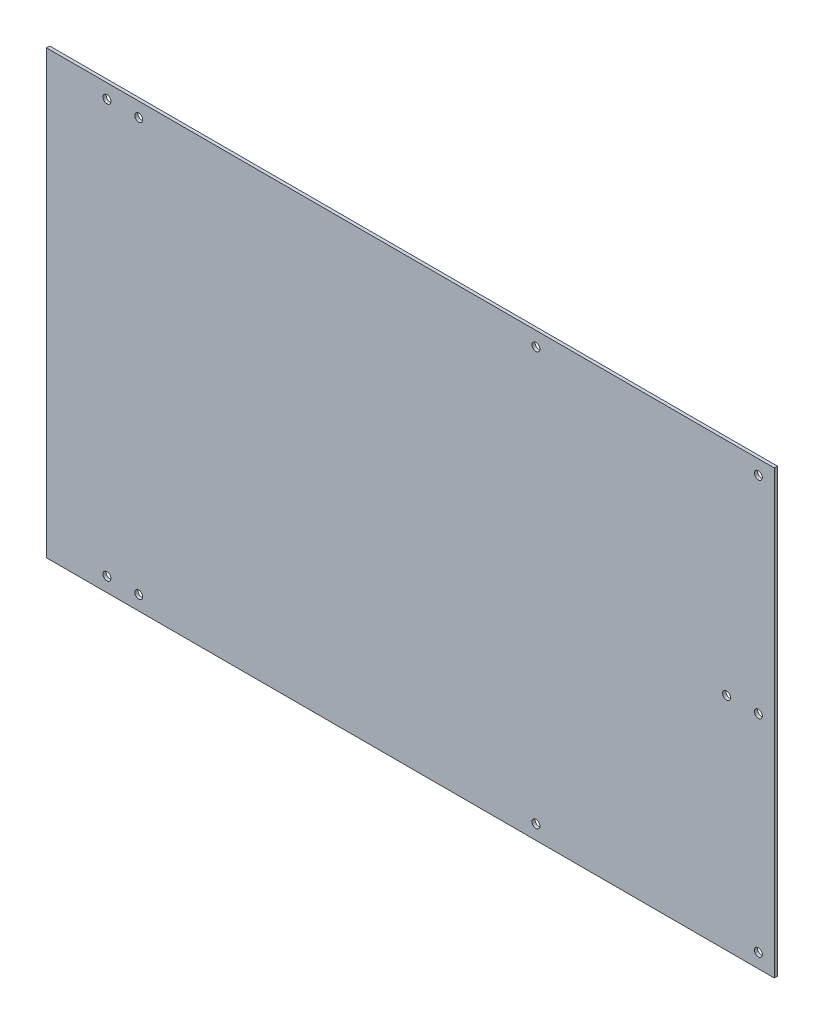
ISO-10303-21;
HEADER;
FILE_DESCRIPTION(('STEP AP214'),'2;1');
FILE_NAME('part.step','',(''),(''),'','','');
FILE_SCHEMA(('AUTOMOTIVE_DESIGN { 1 0 10303 214 1 1 1 1 }'));
ENDSEC;
DATA;
#1=APPLICATION_CONTEXT('core data for automotive mechanical design processes');
#2=APPLICATION_PROTOCOL_DEFINITION('international standard','automotive_design',2000,#1);
#3=PRODUCT_CONTEXT('',#1,'mechanical');
#4=PRODUCT('Part','Part','',(#3));
#5=PRODUCT_RELATED_PRODUCT_CATEGORY('part','',(#4));
#6=PRODUCT_DEFINITION_FORMATION('','',#4);
#7=PRODUCT_DEFINITION_CONTEXT('part definition',#1,'design');
#8=PRODUCT_DEFINITION('design','',#6,#7);
#9=PRODUCT_DEFINITION_SHAPE('','',#8);
#10=(LENGTH_UNIT() NAMED_UNIT(*) SI_UNIT(.MILLI.,.METRE.));
#11=(NAMED_UNIT(*) PLANE_ANGLE_UNIT() SI_UNIT($,.RADIAN.));
#12=(NAMED_UNIT(*) SI_UNIT($,.STERADIAN.) SOLID_ANGLE_UNIT());
#13=UNCERTAINTY_MEASURE_WITH_UNIT(LENGTH_MEASURE(1.E-05),#10,'distance_accuracy_value','');
#14=(GEOMETRIC_REPRESENTATION_CONTEXT(3) GLOBAL_UNCERTAINTY_ASSIGNED_CONTEXT((#13)) GLOBAL_UNIT_ASSIGNED_CONTEXT((#10,
#11,#12)) REPRESENTATION_CONTEXT('',''));
#15=CARTESIAN_POINT('',(0.,0.,0.));
#16=DIRECTION('',(0.,0.,1.));
#17=DIRECTION('',(1.,0.,0.));
#18=AXIS2_PLACEMENT_3D('',#15,#16,#17);
#19=CARTESIAN_POINT('',(0.,0.,2.));
#20=DIRECTION('',(0.,0.,-1.));
#21=DIRECTION('',(-1.,0.,0.));
#22=AXIS2_PLACEMENT_3D('',#19,#20,#21);
#23=PLANE('',#22);
#24=DIRECTION('',(0.,-1.,0.));
#25=VECTOR('',#24,1.);
#26=CARTESIAN_POINT('',(-113.50919013501,-235.636228994094,2.));
#27=LINE('',#26,#25);
#28=CARTESIAN_POINT('',(-113.50919013501,42.3637710059059,2.));
#29=VERTEX_POINT('',#28);
#30=CARTESIAN_POINT('',(-113.50919013501,-235.636228994094,2.));
#31=VERTEX_POINT('',#30);
#32=EDGE_CURVE('E87',#29,#31,#27,.T.);
#33=ORIENTED_EDGE('',*,*,#32,.T.);
#34=DIRECTION('',(1.,0.,0.));
#35=VECTOR('',#34,1.);
#36=CARTESIAN_POINT('',(344.49080986499,-235.636228994094,2.));
#37=LINE('',#36,#35);
#38=CARTESIAN_POINT('',(344.49080986499,-235.636228994094,2.));
#39=VERTEX_POINT('',#38);
#40=EDGE_CURVE('E82',#31,#39,#37,.T.);
#41=ORIENTED_EDGE('',*,*,#40,.T.);
#42=DIRECTION('',(0.,1.,0.));
#43=VECTOR('',#42,1.);
#44=CARTESIAN_POINT('',(344.49080986499,42.3637710059059,2.));
#45=LINE('',#44,#43);
#46=CARTESIAN_POINT('',(344.49080986499,42.3637710059059,2.));
#47=VERTEX_POINT('',#46);
#48=EDGE_CURVE('E85',#39,#47,#45,.T.);
#49=ORIENTED_EDGE('',*,*,#48,.T.);
#50=DIRECTION('',(-1.,0.,0.));
#51=VECTOR('',#50,1.);
#52=CARTESIAN_POINT('',(-113.50919013501,42.3637710059059,2.));
#53=LINE('',#52,#51);
#54=EDGE_CURVE('E52',#47,#29,#53,.T.);
#55=ORIENTED_EDGE('',*,*,#54,.T.);
#56=EDGE_LOOP('',(#33,#41,#49,#55));
#57=FACE_BOUND('',#56,.T.);
#58=CARTESIAN_POINT('',(334.49080986499,-226.636228994094,2.));
#59=DIRECTION('',(0.,0.,1.));
#60=DIRECTION('',(1.,0.,0.));
#61=AXIS2_PLACEMENT_3D('',#58,#59,#60);
#62=CIRCLE('',#61,2.49999999999997);
#63=CARTESIAN_POINT('',(336.99080986499,-226.636228994094,2.));
#64=VERTEX_POINT('',#63);
#65=EDGE_CURVE('E102',#64,#64,#62,.T.);
#66=ORIENTED_EDGE('',*,*,#65,.F.);
#67=EDGE_LOOP('',(#66));
#68=FACE_BOUND('',#67,.T.);
#69=CARTESIAN_POINT('',(194.49080986499,-226.636228994094,2.));
#70=DIRECTION('',(0.,0.,1.));
#71=DIRECTION('',(1.,0.,0.));
#72=AXIS2_PLACEMENT_3D('',#69,#70,#71);
#73=CIRCLE('',#72,2.5);
#74=CARTESIAN_POINT('',(196.99080986499,-226.636228994094,2.));
#75=VERTEX_POINT('',#74);
#76=EDGE_CURVE('E117',#75,#75,#73,.T.);
#77=ORIENTED_EDGE('',*,*,#76,.F.);
#78=EDGE_LOOP('',(#77));
#79=FACE_BOUND('',#78,.T.);
#80=CARTESIAN_POINT('',(194.49080986499,33.3637710059059,2.));
#81=DIRECTION('',(0.,0.,1.));
#82=DIRECTION('',(-1.,0.,0.));
#83=AXIS2_PLACEMENT_3D('',#80,#81,#82);
#84=CIRCLE('',#83,2.5);
#85=CARTESIAN_POINT('',(191.99080986499,33.3637710059059,2.));
#86=VERTEX_POINT('',#85);
#87=EDGE_CURVE('E123',#86,#86,#84,.T.);
#88=ORIENTED_EDGE('',*,*,#87,.F.);
#89=EDGE_LOOP('',(#88));
#90=FACE_BOUND('',#89,.T.);
#91=CARTESIAN_POINT('',(334.49080986499,33.3637710059059,2.));
#92=DIRECTION('',(0.,0.,1.));
#93=DIRECTION('',(-1.,0.,0.));
#94=AXIS2_PLACEMENT_3D('',#91,#92,#93);
#95=CIRCLE('',#94,2.49999999999997);
#96=CARTESIAN_POINT('',(331.99080986499,33.3637710059059,2.));
#97=VERTEX_POINT('',#96);
#98=EDGE_CURVE('E129',#97,#97,#95,.T.);
#99=ORIENTED_EDGE('',*,*,#98,.F.);
#100=EDGE_LOOP('',(#99));
#101=FACE_BOUND('',#100,.T.);
#102=CARTESIAN_POINT('',(-55.5091901350102,33.3637710059059,2.));
#103=DIRECTION('',(0.,0.,1.));
#104=DIRECTION('',(1.,0.,0.));
#105=AXIS2_PLACEMENT_3D('',#102,#103,#104);
#106=CIRCLE('',#105,2.5);
#107=CARTESIAN_POINT('',(-53.0091901350102,33.3637710059059,2.));
#108=VERTEX_POINT('',#107);
#109=EDGE_CURVE('E135',#108,#108,#106,.T.);
#110=ORIENTED_EDGE('',*,*,#109,.F.);
#111=EDGE_LOOP('',(#110));
#112=FACE_BOUND('',#111,.T.);
#113=CARTESIAN_POINT('',(-75.5091901350102,33.3637710059059,2.));
#114=DIRECTION('',(0.,0.,1.));
#115=DIRECTION('',(1.,0.,0.));
#116=AXIS2_PLACEMENT_3D('',#113,#114,#115);
#117=CIRCLE('',#116,2.5);
#118=CARTESIAN_POINT('',(-73.0091901350102,33.3637710059059,2.));
#119=VERTEX_POINT('',#118);
#120=EDGE_CURVE('E141',#119,#119,#117,.T.);
#121=ORIENTED_EDGE('',*,*,#120,.F.);
#122=EDGE_LOOP('',(#121));
#123=FACE_BOUND('',#122,.T.);
#124=CARTESIAN_POINT('',(-75.50919013501,-226.636228994094,2.));
#125=DIRECTION('',(0.,0.,1.));
#126=DIRECTION('',(-1.,0.,0.));
#127=AXIS2_PLACEMENT_3D('',#124,#125,#126);
#128=CIRCLE('',#127,2.5);
#129=CARTESIAN_POINT('',(-78.00919013501,-226.636228994094,2.));
#130=VERTEX_POINT('',#129);
#131=EDGE_CURVE('E147',#130,#130,#128,.T.);
#132=ORIENTED_EDGE('',*,*,#131,.F.);
#133=EDGE_LOOP('',(#132));
#134=FACE_BOUND('',#133,.T.);
#135=CARTESIAN_POINT('',(-55.50919013501,-226.636228994094,2.));
#136=DIRECTION('',(0.,0.,1.));
#137=DIRECTION('',(-1.,0.,0.));
#138=AXIS2_PLACEMENT_3D('',#135,#136,#137);
#139=CIRCLE('',#138,2.5);
#140=CARTESIAN_POINT('',(-58.00919013501,-226.636228994094,2.));
#141=VERTEX_POINT('',#140);
#142=EDGE_CURVE('E153',#141,#141,#139,.T.);
#143=ORIENTED_EDGE('',*,*,#142,.F.);
#144=EDGE_LOOP('',(#143));
#145=FACE_BOUND('',#144,.T.);
#146=CARTESIAN_POINT('',(334.49080986499,-96.6362289940941,2.));
#147=DIRECTION('',(0.,0.,1.));
#148=DIRECTION('',(1.,0.,0.));
#149=AXIS2_PLACEMENT_3D('',#146,#147,#148);
#150=CIRCLE('',#149,2.50000000000002);
#151=CARTESIAN_POINT('',(336.99080986499,-96.6362289940941,2.));
#152=VERTEX_POINT('',#151);
#153=EDGE_CURVE('E159',#152,#152,#150,.T.);
#154=ORIENTED_EDGE('',*,*,#153,.F.);
#155=EDGE_LOOP('',(#154));
#156=FACE_BOUND('',#155,.T.);
#157=CARTESIAN_POINT('',(314.49080986499,-96.6362289940941,2.));
#158=DIRECTION('',(0.,0.,1.));
#159=DIRECTION('',(1.,0.,0.));
#160=AXIS2_PLACEMENT_3D('',#157,#158,#159);
#161=CIRCLE('',#160,2.49999999999997);
#162=CARTESIAN_POINT('',(316.99080986499,-96.6362289940941,2.));
#163=VERTEX_POINT('',#162);
#164=EDGE_CURVE('E165',#163,#163,#161,.T.);
#165=ORIENTED_EDGE('',*,*,#164,.F.);
#166=EDGE_LOOP('',(#165));
#167=FACE_BOUND('',#166,.T.);
#168=ADVANCED_FACE('F35',(#57,#68,#79,#90,#101,#112,#123,#134,#145,#156,#167),#23,.F.);
#169=CARTESIAN_POINT('',(0.,0.,0.));
#170=DIRECTION('',(0.,0.,-1.));
#171=DIRECTION('',(-1.,0.,0.));
#172=AXIS2_PLACEMENT_3D('',#169,#170,#171);
#173=PLANE('',#172);
#174=CARTESIAN_POINT('',(334.49080986499,-96.6362289940941,0.));
#175=DIRECTION('',(0.,0.,1.));
#176=DIRECTION('',(1.,0.,0.));
#177=AXIS2_PLACEMENT_3D('',#174,#175,#176);
#178=CIRCLE('',#177,2.50000000000002);
#179=CARTESIAN_POINT('',(336.99080986499,-96.6362289940941,0.));
#180=VERTEX_POINT('',#179);
#181=EDGE_CURVE('E162',#180,#180,#178,.T.);
#182=ORIENTED_EDGE('',*,*,#181,.T.);
#183=EDGE_LOOP('',(#182));
#184=FACE_BOUND('',#183,.T.);
#185=CARTESIAN_POINT('',(-75.50919013501,-226.636228994094,0.));
#186=DIRECTION('',(0.,0.,1.));
#187=DIRECTION('',(-1.,0.,0.));
#188=AXIS2_PLACEMENT_3D('',#185,#186,#187);
#189=CIRCLE('',#188,2.5);
#190=CARTESIAN_POINT('',(-78.00919013501,-226.636228994094,0.));
#191=VERTEX_POINT('',#190);
#192=EDGE_CURVE('E150',#191,#191,#189,.T.);
#193=ORIENTED_EDGE('',*,*,#192,.T.);
#194=EDGE_LOOP('',(#193));
#195=FACE_BOUND('',#194,.T.);
#196=CARTESIAN_POINT('',(-55.5091901350102,33.3637710059059,0.));
#197=DIRECTION('',(0.,0.,1.));
#198=DIRECTION('',(1.,0.,0.));
#199=AXIS2_PLACEMENT_3D('',#196,#197,#198);
#200=CIRCLE('',#199,2.5);
#201=CARTESIAN_POINT('',(-53.0091901350102,33.3637710059059,0.));
#202=VERTEX_POINT('',#201);
#203=EDGE_CURVE('E138',#202,#202,#200,.T.);
#204=ORIENTED_EDGE('',*,*,#203,.T.);
#205=EDGE_LOOP('',(#204));
#206=FACE_BOUND('',#205,.T.);
#207=CARTESIAN_POINT('',(194.49080986499,33.3637710059059,0.));
#208=DIRECTION('',(0.,0.,1.));
#209=DIRECTION('',(-1.,0.,0.));
#210=AXIS2_PLACEMENT_3D('',#207,#208,#209);
#211=CIRCLE('',#210,2.5);
#212=CARTESIAN_POINT('',(191.99080986499,33.3637710059059,0.));
#213=VERTEX_POINT('',#212);
#214=EDGE_CURVE('E126',#213,#213,#211,.T.);
#215=ORIENTED_EDGE('',*,*,#214,.T.);
#216=EDGE_LOOP('',(#215));
#217=FACE_BOUND('',#216,.T.);
#218=CARTESIAN_POINT('',(334.49080986499,-226.636228994094,0.));
#219=DIRECTION('',(0.,0.,1.));
#220=DIRECTION('',(1.,0.,0.));
#221=AXIS2_PLACEMENT_3D('',#218,#219,#220);
#222=CIRCLE('',#221,2.49999999999997);
#223=CARTESIAN_POINT('',(336.99080986499,-226.636228994094,0.));
#224=VERTEX_POINT('',#223);
#225=EDGE_CURVE('E114',#224,#224,#222,.T.);
#226=ORIENTED_EDGE('',*,*,#225,.T.);
#227=EDGE_LOOP('',(#226));
#228=FACE_BOUND('',#227,.T.);
#229=DIRECTION('',(0.,-1.,0.));
#230=VECTOR('',#229,1.);
#231=CARTESIAN_POINT('',(-113.50919013501,-235.636228994094,0.));
#232=LINE('',#231,#230);
#233=CARTESIAN_POINT('',(-113.50919013501,42.3637710059059,0.));
#234=VERTEX_POINT('',#233);
#235=CARTESIAN_POINT('',(-113.50919013501,-235.636228994094,0.));
#236=VERTEX_POINT('',#235);
#237=EDGE_CURVE('E99',#234,#236,#232,.T.);
#238=ORIENTED_EDGE('',*,*,#237,.F.);
#239=DIRECTION('',(-1.,0.,0.));
#240=VECTOR('',#239,1.);
#241=CARTESIAN_POINT('',(-113.50919013501,42.3637710059059,0.));
#242=LINE('',#241,#240);
#243=CARTESIAN_POINT('',(344.49080986499,42.3637710059059,0.));
#244=VERTEX_POINT('',#243);
#245=EDGE_CURVE('E75',#244,#234,#242,.T.);
#246=ORIENTED_EDGE('',*,*,#245,.F.);
#247=DIRECTION('',(0.,1.,0.));
#248=VECTOR('',#247,1.);
#249=CARTESIAN_POINT('',(344.49080986499,42.3637710059059,0.));
#250=LINE('',#249,#248);
#251=CARTESIAN_POINT('',(344.49080986499,-235.636228994094,0.));
#252=VERTEX_POINT('',#251);
#253=EDGE_CURVE('E69',#252,#244,#250,.T.);
#254=ORIENTED_EDGE('',*,*,#253,.F.);
#255=DIRECTION('',(1.,0.,0.));
#256=VECTOR('',#255,1.);
#257=CARTESIAN_POINT('',(344.49080986499,-235.636228994094,0.));
#258=LINE('',#257,#256);
#259=EDGE_CURVE('E91',#236,#252,#258,.T.);
#260=ORIENTED_EDGE('',*,*,#259,.F.);
#261=EDGE_LOOP('',(#238,#246,#254,#260));
#262=FACE_BOUND('',#261,.T.);
#263=CARTESIAN_POINT('',(194.49080986499,-226.636228994094,0.));
#264=DIRECTION('',(0.,0.,1.));
#265=DIRECTION('',(1.,0.,0.));
#266=AXIS2_PLACEMENT_3D('',#263,#264,#265);
#267=CIRCLE('',#266,2.5);
#268=CARTESIAN_POINT('',(196.99080986499,-226.636228994094,0.));
#269=VERTEX_POINT('',#268);
#270=EDGE_CURVE('E120',#269,#269,#267,.T.);
#271=ORIENTED_EDGE('',*,*,#270,.T.);
#272=EDGE_LOOP('',(#271));
#273=FACE_BOUND('',#272,.T.);
#274=CARTESIAN_POINT('',(334.49080986499,33.3637710059059,0.));
#275=DIRECTION('',(0.,0.,1.));
#276=DIRECTION('',(-1.,0.,0.));
#277=AXIS2_PLACEMENT_3D('',#274,#275,#276);
#278=CIRCLE('',#277,2.49999999999997);
#279=CARTESIAN_POINT('',(331.99080986499,33.3637710059059,0.));
#280=VERTEX_POINT('',#279);
#281=EDGE_CURVE('E132',#280,#280,#278,.T.);
#282=ORIENTED_EDGE('',*,*,#281,.T.);
#283=EDGE_LOOP('',(#282));
#284=FACE_BOUND('',#283,.T.);
#285=CARTESIAN_POINT('',(-75.5091901350102,33.3637710059059,0.));
#286=DIRECTION('',(0.,0.,1.));
#287=DIRECTION('',(1.,0.,0.));
#288=AXIS2_PLACEMENT_3D('',#285,#286,#287);
#289=CIRCLE('',#288,2.5);
#290=CARTESIAN_POINT('',(-73.0091901350102,33.3637710059059,0.));
#291=VERTEX_POINT('',#290);
#292=EDGE_CURVE('E144',#291,#291,#289,.T.);
#293=ORIENTED_EDGE('',*,*,#292,.T.);
#294=EDGE_LOOP('',(#293));
#295=FACE_BOUND('',#294,.T.);
#296=CARTESIAN_POINT('',(-55.50919013501,-226.636228994094,0.));
#297=DIRECTION('',(0.,0.,1.));
#298=DIRECTION('',(-1.,0.,0.));
#299=AXIS2_PLACEMENT_3D('',#296,#297,#298);
#300=CIRCLE('',#299,2.5);
#301=CARTESIAN_POINT('',(-58.00919013501,-226.636228994094,0.));
#302=VERTEX_POINT('',#301);
#303=EDGE_CURVE('E156',#302,#302,#300,.T.);
#304=ORIENTED_EDGE('',*,*,#303,.T.);
#305=EDGE_LOOP('',(#304));
#306=FACE_BOUND('',#305,.T.);
#307=CARTESIAN_POINT('',(314.49080986499,-96.6362289940941,0.));
#308=DIRECTION('',(0.,0.,1.));
#309=DIRECTION('',(1.,0.,0.));
#310=AXIS2_PLACEMENT_3D('',#307,#308,#309);
#311=CIRCLE('',#310,2.49999999999997);
#312=CARTESIAN_POINT('',(316.99080986499,-96.6362289940941,0.));
#313=VERTEX_POINT('',#312);
#314=EDGE_CURVE('E168',#313,#313,#311,.T.);
#315=ORIENTED_EDGE('',*,*,#314,.T.);
#316=EDGE_LOOP('',(#315));
#317=FACE_BOUND('',#316,.T.);
#318=ADVANCED_FACE('F110',(#184,#195,#206,#217,#228,#262,#273,#284,#295,#306,#317),#173,.T.);
#319=CARTESIAN_POINT('',(-113.50919013501,-235.636228994094,2.));
#320=DIRECTION('',(1.,0.,0.));
#321=DIRECTION('',(0.,0.,-1.));
#322=AXIS2_PLACEMENT_3D('',#319,#320,#321);
#323=PLANE('',#322);
#324=ORIENTED_EDGE('',*,*,#237,.T.);
#325=DIRECTION('',(0.,0.,-1.));
#326=VECTOR('',#325,1.);
#327=CARTESIAN_POINT('',(-113.50919013501,-235.636228994094,2.));
#328=LINE('',#327,#326);
#329=EDGE_CURVE('E11',#31,#236,#328,.T.);
#330=ORIENTED_EDGE('',*,*,#329,.F.);
#331=ORIENTED_EDGE('',*,*,#32,.F.);
#332=DIRECTION('',(0.,0.,-1.));
#333=VECTOR('',#332,1.);
#334=CARTESIAN_POINT('',(-113.50919013501,42.3637710059059,2.));
#335=LINE('',#334,#333);
#336=EDGE_CURVE('E95',#29,#234,#335,.T.);
#337=ORIENTED_EDGE('',*,*,#336,.T.);
#338=EDGE_LOOP('',(#324,#330,#331,#337));
#339=FACE_BOUND('',#338,.T.);
#340=ADVANCED_FACE('F37',(#339),#323,.F.);
#341=CARTESIAN_POINT('',(344.49080986499,-235.636228994094,2.));
#342=DIRECTION('',(0.,1.,0.));
#343=DIRECTION('',(-1.,0.,0.));
#344=AXIS2_PLACEMENT_3D('',#341,#342,#343);
#345=PLANE('',#344);
#346=ORIENTED_EDGE('',*,*,#259,.T.);
#347=DIRECTION('',(0.,0.,-1.));
#348=VECTOR('',#347,1.);
#349=CARTESIAN_POINT('',(344.49080986499,-235.636228994094,2.));
#350=LINE('',#349,#348);
#351=EDGE_CURVE('E44',#39,#252,#350,.T.);
#352=ORIENTED_EDGE('',*,*,#351,.F.);
#353=ORIENTED_EDGE('',*,*,#40,.F.);
#354=ORIENTED_EDGE('',*,*,#329,.T.);
#355=EDGE_LOOP('',(#346,#352,#353,#354));
#356=FACE_BOUND('',#355,.T.);
#357=ADVANCED_FACE('F90',(#356),#345,.F.);
#358=CARTESIAN_POINT('',(344.49080986499,42.3637710059059,2.));
#359=DIRECTION('',(-1.,0.,0.));
#360=DIRECTION('',(0.,0.,1.));
#361=AXIS2_PLACEMENT_3D('',#358,#359,#360);
#362=PLANE('',#361);
#363=ORIENTED_EDGE('',*,*,#253,.T.);
#364=DIRECTION('',(0.,0.,-1.));
#365=VECTOR('',#364,1.);
#366=CARTESIAN_POINT('',(344.49080986499,42.3637710059059,2.));
#367=LINE('',#366,#365);
#368=EDGE_CURVE('E92',#47,#244,#367,.T.);
#369=ORIENTED_EDGE('',*,*,#368,.F.);
#370=ORIENTED_EDGE('',*,*,#48,.F.);
#371=ORIENTED_EDGE('',*,*,#351,.T.);
#372=EDGE_LOOP('',(#363,#369,#370,#371));
#373=FACE_BOUND('',#372,.T.);
#374=ADVANCED_FACE('F93',(#373),#362,.F.);
#375=CARTESIAN_POINT('',(-113.50919013501,42.3637710059059,2.));
#376=DIRECTION('',(0.,-1.,0.));
#377=DIRECTION('',(0.,0.,-1.));
#378=AXIS2_PLACEMENT_3D('',#375,#376,#377);
#379=PLANE('',#378);
#380=ORIENTED_EDGE('',*,*,#245,.T.);
#381=ORIENTED_EDGE('',*,*,#336,.F.);
#382=ORIENTED_EDGE('',*,*,#54,.F.);
#383=ORIENTED_EDGE('',*,*,#368,.T.);
#384=EDGE_LOOP('',(#380,#381,#382,#383));
#385=FACE_BOUND('',#384,.T.);
#386=ADVANCED_FACE('F107',(#385),#379,.F.);
#387=CARTESIAN_POINT('',(334.49080986499,-226.636228994094,2.));
#388=DIRECTION('',(0.,0.,-1.));
#389=DIRECTION('',(-1.,0.,0.));
#390=AXIS2_PLACEMENT_3D('',#387,#388,#389);
#391=CYLINDRICAL_SURFACE('',#390,2.49999999999997);
#392=ORIENTED_EDGE('',*,*,#65,.T.);
#393=EDGE_LOOP('',(#392));
#394=FACE_BOUND('',#393,.T.);
#395=ORIENTED_EDGE('',*,*,#225,.F.);
#396=EDGE_LOOP('',(#395));
#397=FACE_BOUND('',#396,.T.);
#398=ADVANCED_FACE('F185',(#394,#397),#391,.F.);
#399=CARTESIAN_POINT('',(194.49080986499,-226.636228994094,2.));
#400=DIRECTION('',(0.,0.,-1.));
#401=DIRECTION('',(-1.,0.,0.));
#402=AXIS2_PLACEMENT_3D('',#399,#400,#401);
#403=CYLINDRICAL_SURFACE('',#402,2.5);
#404=ORIENTED_EDGE('',*,*,#76,.T.);
#405=EDGE_LOOP('',(#404));
#406=FACE_BOUND('',#405,.T.);
#407=ORIENTED_EDGE('',*,*,#270,.F.);
#408=EDGE_LOOP('',(#407));
#409=FACE_BOUND('',#408,.T.);
#410=ADVANCED_FACE('F231',(#406,#409),#403,.F.);
#411=CARTESIAN_POINT('',(194.49080986499,33.3637710059059,2.));
#412=DIRECTION('',(0.,0.,-1.));
#413=DIRECTION('',(-1.,0.,0.));
#414=AXIS2_PLACEMENT_3D('',#411,#412,#413);
#415=CYLINDRICAL_SURFACE('',#414,2.5);
#416=ORIENTED_EDGE('',*,*,#87,.T.);
#417=EDGE_LOOP('',(#416));
#418=FACE_BOUND('',#417,.T.);
#419=ORIENTED_EDGE('',*,*,#214,.F.);
#420=EDGE_LOOP('',(#419));
#421=FACE_BOUND('',#420,.T.);
#422=ADVANCED_FACE('F239',(#418,#421),#415,.F.);
#423=CARTESIAN_POINT('',(334.49080986499,33.3637710059059,2.));
#424=DIRECTION('',(0.,0.,-1.));
#425=DIRECTION('',(-1.,0.,0.));
#426=AXIS2_PLACEMENT_3D('',#423,#424,#425);
#427=CYLINDRICAL_SURFACE('',#426,2.49999999999997);
#428=ORIENTED_EDGE('',*,*,#98,.T.);
#429=EDGE_LOOP('',(#428));
#430=FACE_BOUND('',#429,.T.);
#431=ORIENTED_EDGE('',*,*,#281,.F.);
#432=EDGE_LOOP('',(#431));
#433=FACE_BOUND('',#432,.T.);
#434=ADVANCED_FACE('F247',(#430,#433),#427,.F.);
#435=CARTESIAN_POINT('',(-55.5091901350102,33.3637710059059,2.));
#436=DIRECTION('',(0.,0.,-1.));
#437=DIRECTION('',(-1.,0.,0.));
#438=AXIS2_PLACEMENT_3D('',#435,#436,#437);
#439=CYLINDRICAL_SURFACE('',#438,2.5);
#440=ORIENTED_EDGE('',*,*,#109,.T.);
#441=EDGE_LOOP('',(#440));
#442=FACE_BOUND('',#441,.T.);
#443=ORIENTED_EDGE('',*,*,#203,.F.);
#444=EDGE_LOOP('',(#443));
#445=FACE_BOUND('',#444,.T.);
#446=ADVANCED_FACE('F256',(#442,#445),#439,.F.);
#447=CARTESIAN_POINT('',(-75.5091901350102,33.3637710059059,2.));
#448=DIRECTION('',(0.,0.,-1.));
#449=DIRECTION('',(-1.,0.,0.));
#450=AXIS2_PLACEMENT_3D('',#447,#448,#449);
#451=CYLINDRICAL_SURFACE('',#450,2.5);
#452=ORIENTED_EDGE('',*,*,#120,.T.);
#453=EDGE_LOOP('',(#452));
#454=FACE_BOUND('',#453,.T.);
#455=ORIENTED_EDGE('',*,*,#292,.F.);
#456=EDGE_LOOP('',(#455));
#457=FACE_BOUND('',#456,.T.);
#458=ADVANCED_FACE('F265',(#454,#457),#451,.F.);
#459=CARTESIAN_POINT('',(-75.50919013501,-226.636228994094,2.));
#460=DIRECTION('',(0.,0.,-1.));
#461=DIRECTION('',(-1.,0.,0.));
#462=AXIS2_PLACEMENT_3D('',#459,#460,#461);
#463=CYLINDRICAL_SURFACE('',#462,2.5);
#464=ORIENTED_EDGE('',*,*,#131,.T.);
#465=EDGE_LOOP('',(#464));
#466=FACE_BOUND('',#465,.T.);
#467=ORIENTED_EDGE('',*,*,#192,.F.);
#468=EDGE_LOOP('',(#467));
#469=FACE_BOUND('',#468,.T.);
#470=ADVANCED_FACE('F274',(#466,#469),#463,.F.);
#471=CARTESIAN_POINT('',(-55.50919013501,-226.636228994094,2.));
#472=DIRECTION('',(0.,0.,-1.));
#473=DIRECTION('',(-1.,0.,0.));
#474=AXIS2_PLACEMENT_3D('',#471,#472,#473);
#475=CYLINDRICAL_SURFACE('',#474,2.5);
#476=ORIENTED_EDGE('',*,*,#142,.T.);
#477=EDGE_LOOP('',(#476));
#478=FACE_BOUND('',#477,.T.);
#479=ORIENTED_EDGE('',*,*,#303,.F.);
#480=EDGE_LOOP('',(#479));
#481=FACE_BOUND('',#480,.T.);
#482=ADVANCED_FACE('F283',(#478,#481),#475,.F.);
#483=CARTESIAN_POINT('',(334.49080986499,-96.6362289940941,2.));
#484=DIRECTION('',(0.,0.,-1.));
#485=DIRECTION('',(-1.,0.,0.));
#486=AXIS2_PLACEMENT_3D('',#483,#484,#485);
#487=CYLINDRICAL_SURFACE('',#486,2.50000000000002);
#488=ORIENTED_EDGE('',*,*,#153,.T.);
#489=EDGE_LOOP('',(#488));
#490=FACE_BOUND('',#489,.T.);
#491=ORIENTED_EDGE('',*,*,#181,.F.);
#492=EDGE_LOOP('',(#491));
#493=FACE_BOUND('',#492,.T.);
#494=ADVANCED_FACE('F292',(#490,#493),#487,.F.);
#495=CARTESIAN_POINT('',(314.49080986499,-96.6362289940941,2.));
#496=DIRECTION('',(0.,0.,-1.));
#497=DIRECTION('',(-1.,0.,0.));
#498=AXIS2_PLACEMENT_3D('',#495,#496,#497);
#499=CYLINDRICAL_SURFACE('',#498,2.49999999999997);
#500=ORIENTED_EDGE('',*,*,#164,.T.);
#501=EDGE_LOOP('',(#500));
#502=FACE_BOUND('',#501,.T.);
#503=ORIENTED_EDGE('',*,*,#314,.F.);
#504=EDGE_LOOP('',(#503));
#505=FACE_BOUND('',#504,.T.);
#506=ADVANCED_FACE('F174',(#502,#505),#499,.F.);
#507=CLOSED_SHELL('',(#168,#318,#340,#357,#374,#386,#398,#410,#422,#434,#446,#458,#470,#482,
#494,#506));
#508=MANIFOLD_SOLID_BREP('B2',#507);
#509=ADVANCED_BREP_SHAPE_REPRESENTATION('',(#18,#508),#14);
#510=SHAPE_DEFINITION_REPRESENTATION(#9,#509);
ENDSEC;
END-ISO-10303-21;
